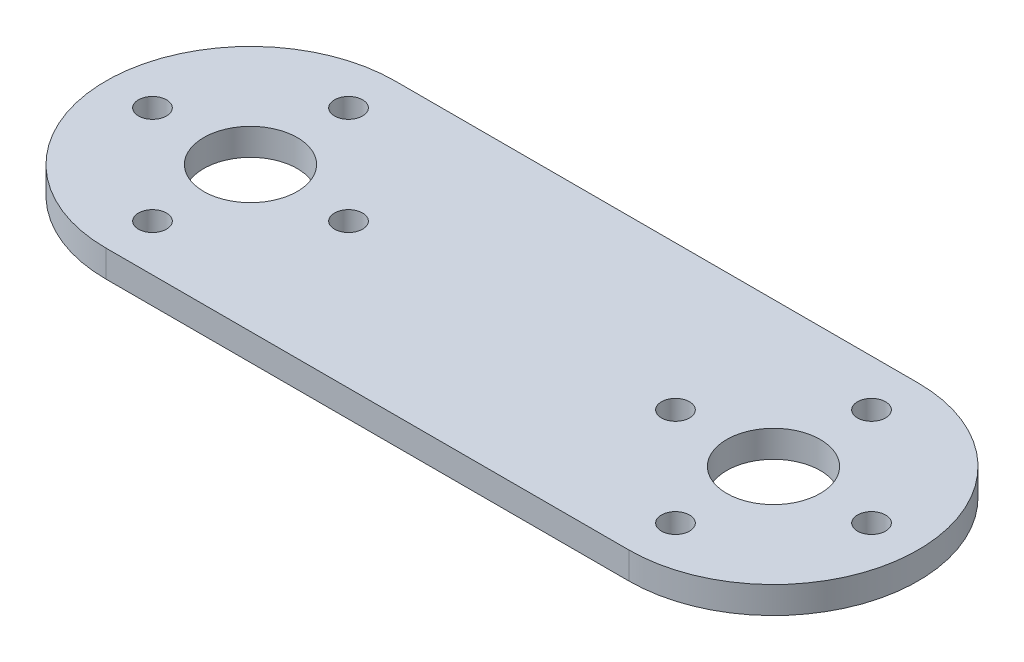
ISO-10303-21;
HEADER;
FILE_DESCRIPTION(('STEP AP214'),'2;1');
FILE_NAME('part.step','',(''),(''),'','','');
FILE_SCHEMA(('AUTOMOTIVE_DESIGN { 1 0 10303 214 1 1 1 1 }'));
ENDSEC;
DATA;
#1=APPLICATION_CONTEXT('core data for automotive mechanical design processes');
#2=APPLICATION_PROTOCOL_DEFINITION('international standard','automotive_design',2000,#1);
#3=PRODUCT_CONTEXT('',#1,'mechanical');
#4=PRODUCT('Part','Part','',(#3));
#5=PRODUCT_RELATED_PRODUCT_CATEGORY('part','',(#4));
#6=PRODUCT_DEFINITION_FORMATION('','',#4);
#7=PRODUCT_DEFINITION_CONTEXT('part definition',#1,'design');
#8=PRODUCT_DEFINITION('design','',#6,#7);
#9=PRODUCT_DEFINITION_SHAPE('','',#8);
#10=(LENGTH_UNIT() NAMED_UNIT(*) SI_UNIT(.MILLI.,.METRE.));
#11=(NAMED_UNIT(*) PLANE_ANGLE_UNIT() SI_UNIT($,.RADIAN.));
#12=(NAMED_UNIT(*) SI_UNIT($,.STERADIAN.) SOLID_ANGLE_UNIT());
#13=UNCERTAINTY_MEASURE_WITH_UNIT(LENGTH_MEASURE(1.E-05),#10,'distance_accuracy_value','');
#14=(GEOMETRIC_REPRESENTATION_CONTEXT(3) GLOBAL_UNCERTAINTY_ASSIGNED_CONTEXT((#13)) GLOBAL_UNIT_ASSIGNED_CONTEXT((#10,
#11,#12)) REPRESENTATION_CONTEXT('',''));
#15=CARTESIAN_POINT('',(0.,0.,0.));
#16=DIRECTION('',(0.,0.,1.));
#17=DIRECTION('',(1.,0.,0.));
#18=AXIS2_PLACEMENT_3D('',#15,#16,#17);
#19=CARTESIAN_POINT('',(22.225,2.286,0.));
#20=DIRECTION('',(0.,-1.,0.));
#21=DIRECTION('',(0.,0.,-1.));
#22=AXIS2_PLACEMENT_3D('',#19,#20,#21);
#23=CYLINDRICAL_SURFACE('',#22,12.2936);
#24=DIRECTION('',(0.,-1.,0.));
#25=VECTOR('',#24,1.);
#26=CARTESIAN_POINT('',(22.225,2.286,-12.2936));
#27=LINE('',#26,#25);
#28=CARTESIAN_POINT('',(22.225,2.286,-12.2936));
#29=VERTEX_POINT('',#28);
#30=CARTESIAN_POINT('',(22.225,0.,-12.2936));
#31=VERTEX_POINT('',#30);
#32=EDGE_CURVE('E76',#29,#31,#27,.T.);
#33=ORIENTED_EDGE('',*,*,#32,.F.);
#34=CARTESIAN_POINT('',(22.225,2.286,0.));
#35=DIRECTION('',(0.,1.,0.));
#36=DIRECTION('',(0.,0.,1.));
#37=AXIS2_PLACEMENT_3D('',#34,#35,#36);
#38=CIRCLE('',#37,12.2936);
#39=CARTESIAN_POINT('',(22.225,2.286,12.2936));
#40=VERTEX_POINT('',#39);
#41=EDGE_CURVE('E39',#40,#29,#38,.T.);
#42=ORIENTED_EDGE('',*,*,#41,.F.);
#43=DIRECTION('',(0.,-1.,0.));
#44=VECTOR('',#43,1.);
#45=CARTESIAN_POINT('',(22.225,2.286,12.2936));
#46=LINE('',#45,#44);
#47=CARTESIAN_POINT('',(22.225,0.,12.2936));
#48=VERTEX_POINT('',#47);
#49=EDGE_CURVE('E100',#48,#40,#46,.F.);
#50=ORIENTED_EDGE('',*,*,#49,.F.);
#51=CARTESIAN_POINT('',(22.225,0.,0.));
#52=DIRECTION('',(0.,1.,0.));
#53=DIRECTION('',(0.,0.,1.));
#54=AXIS2_PLACEMENT_3D('',#51,#52,#53);
#55=CIRCLE('',#54,12.2936);
#56=EDGE_CURVE('E11',#31,#48,#55,.F.);
#57=ORIENTED_EDGE('',*,*,#56,.F.);
#58=EDGE_LOOP('',(#33,#42,#50,#57));
#59=FACE_BOUND('',#58,.T.);
#60=ADVANCED_FACE('F32',(#59),#23,.T.);
#61=CARTESIAN_POINT('',(-22.225,0.,0.));
#62=DIRECTION('',(0.,-1.,0.));
#63=DIRECTION('',(0.,0.,-1.));
#64=AXIS2_PLACEMENT_3D('',#61,#62,#63);
#65=CYLINDRICAL_SURFACE('',#64,12.2936);
#66=DIRECTION('',(0.,-1.,0.));
#67=VECTOR('',#66,1.);
#68=CARTESIAN_POINT('',(-22.225,2.286,-12.2936));
#69=LINE('',#68,#67);
#70=CARTESIAN_POINT('',(-22.225,0.,-12.2936));
#71=VERTEX_POINT('',#70);
#72=CARTESIAN_POINT('',(-22.225,2.286,-12.2936));
#73=VERTEX_POINT('',#72);
#74=EDGE_CURVE('E75',#71,#73,#69,.F.);
#75=ORIENTED_EDGE('',*,*,#74,.F.);
#76=CARTESIAN_POINT('',(-22.225,0.,0.));
#77=DIRECTION('',(0.,1.,0.));
#78=DIRECTION('',(0.,0.,1.));
#79=AXIS2_PLACEMENT_3D('',#76,#77,#78);
#80=CIRCLE('',#79,12.2936);
#81=CARTESIAN_POINT('',(-22.225,0.,12.2936));
#82=VERTEX_POINT('',#81);
#83=EDGE_CURVE('E80',#82,#71,#80,.F.);
#84=ORIENTED_EDGE('',*,*,#83,.F.);
#85=DIRECTION('',(0.,-1.,0.));
#86=VECTOR('',#85,1.);
#87=CARTESIAN_POINT('',(-22.225,2.286,12.2936));
#88=LINE('',#87,#86);
#89=CARTESIAN_POINT('',(-22.225,2.286,12.2936));
#90=VERTEX_POINT('',#89);
#91=EDGE_CURVE('E88',#90,#82,#88,.T.);
#92=ORIENTED_EDGE('',*,*,#91,.F.);
#93=CARTESIAN_POINT('',(-22.225,2.286,0.));
#94=DIRECTION('',(0.,1.,0.));
#95=DIRECTION('',(0.,0.,1.));
#96=AXIS2_PLACEMENT_3D('',#93,#94,#95);
#97=CIRCLE('',#96,12.2936);
#98=EDGE_CURVE('E87',#73,#90,#97,.T.);
#99=ORIENTED_EDGE('',*,*,#98,.F.);
#100=EDGE_LOOP('',(#75,#84,#92,#99));
#101=FACE_BOUND('',#100,.T.);
#102=ADVANCED_FACE('F91',(#101),#65,.T.);
#103=CARTESIAN_POINT('',(-34.5186,2.286,12.2936));
#104=DIRECTION('',(0.,1.,0.));
#105=DIRECTION('',(0.,0.,1.));
#106=AXIS2_PLACEMENT_3D('',#103,#104,#105);
#107=PLANE('',#106);
#108=CARTESIAN_POINT('',(22.225,2.286,0.));
#109=DIRECTION('',(0.,1.,0.));
#110=DIRECTION('',(0.,0.,1.));
#111=AXIS2_PLACEMENT_3D('',#108,#109,#110);
#112=CIRCLE('',#111,3.9751);
#113=CARTESIAN_POINT('',(22.225,2.286,3.9751));
#114=VERTEX_POINT('',#113);
#115=EDGE_CURVE('E156',#114,#114,#112,.T.);
#116=ORIENTED_EDGE('',*,*,#115,.F.);
#117=EDGE_LOOP('',(#116));
#118=FACE_BOUND('',#117,.T.);
#119=CARTESIAN_POINT('',(22.225,2.286,-8.3312));
#120=DIRECTION('',(0.,1.,0.));
#121=DIRECTION('',(0.,0.,1.));
#122=AXIS2_PLACEMENT_3D('',#119,#120,#121);
#123=CIRCLE('',#122,1.1938);
#124=CARTESIAN_POINT('',(22.225,2.286,-7.1374));
#125=VERTEX_POINT('',#124);
#126=EDGE_CURVE('E144',#125,#125,#123,.T.);
#127=ORIENTED_EDGE('',*,*,#126,.F.);
#128=EDGE_LOOP('',(#127));
#129=FACE_BOUND('',#128,.T.);
#130=CARTESIAN_POINT('',(22.225,2.286,8.3312));
#131=DIRECTION('',(0.,1.,0.));
#132=DIRECTION('',(0.,0.,1.));
#133=AXIS2_PLACEMENT_3D('',#130,#131,#132);
#134=CIRCLE('',#133,1.1938);
#135=CARTESIAN_POINT('',(22.225,2.286,9.525));
#136=VERTEX_POINT('',#135);
#137=EDGE_CURVE('E132',#136,#136,#134,.T.);
#138=ORIENTED_EDGE('',*,*,#137,.F.);
#139=EDGE_LOOP('',(#138));
#140=FACE_BOUND('',#139,.T.);
#141=CARTESIAN_POINT('',(-22.225,2.286,8.3312));
#142=DIRECTION('',(0.,1.,0.));
#143=DIRECTION('',(0.,0.,1.));
#144=AXIS2_PLACEMENT_3D('',#141,#142,#143);
#145=CIRCLE('',#144,1.1938);
#146=CARTESIAN_POINT('',(-22.225,2.286,9.52500000000001));
#147=VERTEX_POINT('',#146);
#148=EDGE_CURVE('E120',#147,#147,#145,.T.);
#149=ORIENTED_EDGE('',*,*,#148,.F.);
#150=EDGE_LOOP('',(#149));
#151=FACE_BOUND('',#150,.T.);
#152=CARTESIAN_POINT('',(-22.225,2.286,-8.3312));
#153=DIRECTION('',(0.,1.,0.));
#154=DIRECTION('',(0.,0.,1.));
#155=AXIS2_PLACEMENT_3D('',#152,#153,#154);
#156=CIRCLE('',#155,1.1938);
#157=CARTESIAN_POINT('',(-22.225,2.286,-7.1374));
#158=VERTEX_POINT('',#157);
#159=EDGE_CURVE('E108',#158,#158,#156,.T.);
#160=ORIENTED_EDGE('',*,*,#159,.F.);
#161=EDGE_LOOP('',(#160));
#162=FACE_BOUND('',#161,.T.);
#163=DIRECTION('',(1.,0.,0.));
#164=VECTOR('',#163,1.);
#165=CARTESIAN_POINT('',(-34.5186,2.286,12.2936));
#166=LINE('',#165,#164);
#167=EDGE_CURVE('E77',#90,#40,#166,.T.);
#168=ORIENTED_EDGE('',*,*,#167,.T.);
#169=ORIENTED_EDGE('',*,*,#41,.T.);
#170=DIRECTION('',(-1.,0.,0.));
#171=VECTOR('',#170,1.);
#172=CARTESIAN_POINT('',(-34.5186,2.286,-12.2936));
#173=LINE('',#172,#171);
#174=EDGE_CURVE('E92',#29,#73,#173,.T.);
#175=ORIENTED_EDGE('',*,*,#174,.T.);
#176=ORIENTED_EDGE('',*,*,#98,.T.);
#177=EDGE_LOOP('',(#168,#169,#175,#176));
#178=FACE_BOUND('',#177,.T.);
#179=CARTESIAN_POINT('',(-13.8938,2.286,0.));
#180=DIRECTION('',(0.,1.,0.));
#181=DIRECTION('',(0.,0.,1.));
#182=AXIS2_PLACEMENT_3D('',#179,#180,#181);
#183=CIRCLE('',#182,1.1938);
#184=CARTESIAN_POINT('',(-13.8938,2.286,1.1938));
#185=VERTEX_POINT('',#184);
#186=EDGE_CURVE('E115',#185,#185,#183,.T.);
#187=ORIENTED_EDGE('',*,*,#186,.F.);
#188=EDGE_LOOP('',(#187));
#189=FACE_BOUND('',#188,.T.);
#190=CARTESIAN_POINT('',(-30.5562,2.286,0.));
#191=DIRECTION('',(0.,1.,0.));
#192=DIRECTION('',(0.,0.,1.));
#193=AXIS2_PLACEMENT_3D('',#190,#191,#192);
#194=CIRCLE('',#193,1.1938);
#195=CARTESIAN_POINT('',(-30.5562,2.286,1.1938));
#196=VERTEX_POINT('',#195);
#197=EDGE_CURVE('E126',#196,#196,#194,.T.);
#198=ORIENTED_EDGE('',*,*,#197,.F.);
#199=EDGE_LOOP('',(#198));
#200=FACE_BOUND('',#199,.T.);
#201=CARTESIAN_POINT('',(30.5562,2.286,0.));
#202=DIRECTION('',(0.,1.,0.));
#203=DIRECTION('',(0.,0.,1.));
#204=AXIS2_PLACEMENT_3D('',#201,#202,#203);
#205=CIRCLE('',#204,1.1938);
#206=CARTESIAN_POINT('',(30.5562,2.286,1.1938));
#207=VERTEX_POINT('',#206);
#208=EDGE_CURVE('E138',#207,#207,#205,.T.);
#209=ORIENTED_EDGE('',*,*,#208,.F.);
#210=EDGE_LOOP('',(#209));
#211=FACE_BOUND('',#210,.T.);
#212=CARTESIAN_POINT('',(13.8938,2.286,0.));
#213=DIRECTION('',(0.,1.,0.));
#214=DIRECTION('',(0.,0.,1.));
#215=AXIS2_PLACEMENT_3D('',#212,#213,#214);
#216=CIRCLE('',#215,1.1938);
#217=CARTESIAN_POINT('',(13.8938,2.286,1.1938));
#218=VERTEX_POINT('',#217);
#219=EDGE_CURVE('E150',#218,#218,#216,.T.);
#220=ORIENTED_EDGE('',*,*,#219,.F.);
#221=EDGE_LOOP('',(#220));
#222=FACE_BOUND('',#221,.T.);
#223=CARTESIAN_POINT('',(-22.225,2.286,0.));
#224=DIRECTION('',(0.,1.,0.));
#225=DIRECTION('',(0.,0.,1.));
#226=AXIS2_PLACEMENT_3D('',#223,#224,#225);
#227=CIRCLE('',#226,3.9751);
#228=CARTESIAN_POINT('',(-22.225,2.286,3.9751));
#229=VERTEX_POINT('',#228);
#230=EDGE_CURVE('E162',#229,#229,#227,.T.);
#231=ORIENTED_EDGE('',*,*,#230,.F.);
#232=EDGE_LOOP('',(#231));
#233=FACE_BOUND('',#232,.T.);
#234=ADVANCED_FACE('F103',(#118,#129,#140,#151,#162,#178,#189,#200,#211,#222,#233),#107,.T.);
#235=CARTESIAN_POINT('',(-34.5186,0.,12.2936));
#236=DIRECTION('',(0.,1.,0.));
#237=DIRECTION('',(0.,0.,1.));
#238=AXIS2_PLACEMENT_3D('',#235,#236,#237);
#239=PLANE('',#238);
#240=CARTESIAN_POINT('',(22.225,0.,0.));
#241=DIRECTION('',(0.,1.,0.));
#242=DIRECTION('',(0.,0.,1.));
#243=AXIS2_PLACEMENT_3D('',#240,#241,#242);
#244=CIRCLE('',#243,3.9751);
#245=CARTESIAN_POINT('',(22.225,0.,3.9751));
#246=VERTEX_POINT('',#245);
#247=EDGE_CURVE('E159',#246,#246,#244,.T.);
#248=ORIENTED_EDGE('',*,*,#247,.T.);
#249=EDGE_LOOP('',(#248));
#250=FACE_BOUND('',#249,.T.);
#251=CARTESIAN_POINT('',(22.225,0.,-8.3312));
#252=DIRECTION('',(0.,1.,0.));
#253=DIRECTION('',(0.,0.,1.));
#254=AXIS2_PLACEMENT_3D('',#251,#252,#253);
#255=CIRCLE('',#254,1.1938);
#256=CARTESIAN_POINT('',(22.225,0.,-7.1374));
#257=VERTEX_POINT('',#256);
#258=EDGE_CURVE('E147',#257,#257,#255,.T.);
#259=ORIENTED_EDGE('',*,*,#258,.T.);
#260=EDGE_LOOP('',(#259));
#261=FACE_BOUND('',#260,.T.);
#262=CARTESIAN_POINT('',(22.225,0.,8.3312));
#263=DIRECTION('',(0.,1.,0.));
#264=DIRECTION('',(0.,0.,1.));
#265=AXIS2_PLACEMENT_3D('',#262,#263,#264);
#266=CIRCLE('',#265,1.1938);
#267=CARTESIAN_POINT('',(22.225,0.,9.525));
#268=VERTEX_POINT('',#267);
#269=EDGE_CURVE('E135',#268,#268,#266,.T.);
#270=ORIENTED_EDGE('',*,*,#269,.T.);
#271=EDGE_LOOP('',(#270));
#272=FACE_BOUND('',#271,.T.);
#273=CARTESIAN_POINT('',(-22.225,0.,8.3312));
#274=DIRECTION('',(0.,1.,0.));
#275=DIRECTION('',(0.,0.,1.));
#276=AXIS2_PLACEMENT_3D('',#273,#274,#275);
#277=CIRCLE('',#276,1.1938);
#278=CARTESIAN_POINT('',(-22.225,0.,9.52500000000001));
#279=VERTEX_POINT('',#278);
#280=EDGE_CURVE('E123',#279,#279,#277,.T.);
#281=ORIENTED_EDGE('',*,*,#280,.T.);
#282=EDGE_LOOP('',(#281));
#283=FACE_BOUND('',#282,.T.);
#284=CARTESIAN_POINT('',(-22.225,0.,-8.3312));
#285=DIRECTION('',(0.,1.,0.));
#286=DIRECTION('',(0.,0.,1.));
#287=AXIS2_PLACEMENT_3D('',#284,#285,#286);
#288=CIRCLE('',#287,1.1938);
#289=CARTESIAN_POINT('',(-22.225,0.,-7.1374));
#290=VERTEX_POINT('',#289);
#291=EDGE_CURVE('E110',#290,#290,#288,.T.);
#292=ORIENTED_EDGE('',*,*,#291,.T.);
#293=EDGE_LOOP('',(#292));
#294=FACE_BOUND('',#293,.T.);
#295=DIRECTION('',(-1.,0.,0.));
#296=VECTOR('',#295,1.);
#297=CARTESIAN_POINT('',(-34.5186,0.,-12.2936));
#298=LINE('',#297,#296);
#299=EDGE_CURVE('E70',#31,#71,#298,.T.);
#300=ORIENTED_EDGE('',*,*,#299,.F.);
#301=ORIENTED_EDGE('',*,*,#56,.T.);
#302=DIRECTION('',(1.,0.,0.));
#303=VECTOR('',#302,1.);
#304=CARTESIAN_POINT('',(-34.5186,0.,12.2936));
#305=LINE('',#304,#303);
#306=EDGE_CURVE('E78',#82,#48,#305,.T.);
#307=ORIENTED_EDGE('',*,*,#306,.F.);
#308=ORIENTED_EDGE('',*,*,#83,.T.);
#309=EDGE_LOOP('',(#300,#301,#307,#308));
#310=FACE_BOUND('',#309,.T.);
#311=CARTESIAN_POINT('',(-13.8938,0.,0.));
#312=DIRECTION('',(0.,1.,0.));
#313=DIRECTION('',(0.,0.,1.));
#314=AXIS2_PLACEMENT_3D('',#311,#312,#313);
#315=CIRCLE('',#314,1.1938);
#316=CARTESIAN_POINT('',(-13.8938,0.,1.1938));
#317=VERTEX_POINT('',#316);
#318=EDGE_CURVE('E117',#317,#317,#315,.T.);
#319=ORIENTED_EDGE('',*,*,#318,.T.);
#320=EDGE_LOOP('',(#319));
#321=FACE_BOUND('',#320,.T.);
#322=CARTESIAN_POINT('',(-30.5562,0.,0.));
#323=DIRECTION('',(0.,1.,0.));
#324=DIRECTION('',(0.,0.,1.));
#325=AXIS2_PLACEMENT_3D('',#322,#323,#324);
#326=CIRCLE('',#325,1.1938);
#327=CARTESIAN_POINT('',(-30.5562,0.,1.1938));
#328=VERTEX_POINT('',#327);
#329=EDGE_CURVE('E129',#328,#328,#326,.T.);
#330=ORIENTED_EDGE('',*,*,#329,.T.);
#331=EDGE_LOOP('',(#330));
#332=FACE_BOUND('',#331,.T.);
#333=CARTESIAN_POINT('',(30.5562,0.,0.));
#334=DIRECTION('',(0.,1.,0.));
#335=DIRECTION('',(0.,0.,1.));
#336=AXIS2_PLACEMENT_3D('',#333,#334,#335);
#337=CIRCLE('',#336,1.1938);
#338=CARTESIAN_POINT('',(30.5562,0.,1.1938));
#339=VERTEX_POINT('',#338);
#340=EDGE_CURVE('E141',#339,#339,#337,.T.);
#341=ORIENTED_EDGE('',*,*,#340,.T.);
#342=EDGE_LOOP('',(#341));
#343=FACE_BOUND('',#342,.T.);
#344=CARTESIAN_POINT('',(13.8938,0.,0.));
#345=DIRECTION('',(0.,1.,0.));
#346=DIRECTION('',(0.,0.,1.));
#347=AXIS2_PLACEMENT_3D('',#344,#345,#346);
#348=CIRCLE('',#347,1.1938);
#349=CARTESIAN_POINT('',(13.8938,0.,1.1938));
#350=VERTEX_POINT('',#349);
#351=EDGE_CURVE('E153',#350,#350,#348,.T.);
#352=ORIENTED_EDGE('',*,*,#351,.T.);
#353=EDGE_LOOP('',(#352));
#354=FACE_BOUND('',#353,.T.);
#355=CARTESIAN_POINT('',(-22.225,0.,0.));
#356=DIRECTION('',(0.,1.,0.));
#357=DIRECTION('',(0.,0.,1.));
#358=AXIS2_PLACEMENT_3D('',#355,#356,#357);
#359=CIRCLE('',#358,3.9751);
#360=CARTESIAN_POINT('',(-22.225,0.,3.9751));
#361=VERTEX_POINT('',#360);
#362=EDGE_CURVE('E165',#361,#361,#359,.T.);
#363=ORIENTED_EDGE('',*,*,#362,.T.);
#364=EDGE_LOOP('',(#363));
#365=FACE_BOUND('',#364,.T.);
#366=ADVANCED_FACE('F81',(#250,#261,#272,#283,#294,#310,#321,#332,#343,#354,#365),#239,.F.);
#367=CARTESIAN_POINT('',(-34.5186,2.286,12.2936));
#368=DIRECTION('',(0.,0.,-1.));
#369=DIRECTION('',(-1.,0.,0.));
#370=AXIS2_PLACEMENT_3D('',#367,#368,#369);
#371=PLANE('',#370);
#372=ORIENTED_EDGE('',*,*,#306,.T.);
#373=ORIENTED_EDGE('',*,*,#49,.T.);
#374=ORIENTED_EDGE('',*,*,#167,.F.);
#375=ORIENTED_EDGE('',*,*,#91,.T.);
#376=EDGE_LOOP('',(#372,#373,#374,#375));
#377=FACE_BOUND('',#376,.T.);
#378=ADVANCED_FACE('F107',(#377),#371,.F.);
#379=CARTESIAN_POINT('',(-34.5186,2.286,-12.2936));
#380=DIRECTION('',(0.,0.,1.));
#381=DIRECTION('',(1.,0.,0.));
#382=AXIS2_PLACEMENT_3D('',#379,#380,#381);
#383=PLANE('',#382);
#384=ORIENTED_EDGE('',*,*,#174,.F.);
#385=ORIENTED_EDGE('',*,*,#32,.T.);
#386=ORIENTED_EDGE('',*,*,#299,.T.);
#387=ORIENTED_EDGE('',*,*,#74,.T.);
#388=EDGE_LOOP('',(#384,#385,#386,#387));
#389=FACE_BOUND('',#388,.T.);
#390=ADVANCED_FACE('F73',(#389),#383,.F.);
#391=CARTESIAN_POINT('',(-22.225,2.286,-8.3312));
#392=DIRECTION('',(0.,-1.,0.));
#393=DIRECTION('',(0.,0.,-1.));
#394=AXIS2_PLACEMENT_3D('',#391,#392,#393);
#395=CYLINDRICAL_SURFACE('',#394,1.1938);
#396=ORIENTED_EDGE('',*,*,#159,.T.);
#397=EDGE_LOOP('',(#396));
#398=FACE_BOUND('',#397,.T.);
#399=ORIENTED_EDGE('',*,*,#291,.F.);
#400=EDGE_LOOP('',(#399));
#401=FACE_BOUND('',#400,.T.);
#402=ADVANCED_FACE('F289',(#398,#401),#395,.F.);
#403=CARTESIAN_POINT('',(-13.8938,2.286,0.));
#404=DIRECTION('',(0.,-1.,0.));
#405=DIRECTION('',(0.,0.,-1.));
#406=AXIS2_PLACEMENT_3D('',#403,#404,#405);
#407=CYLINDRICAL_SURFACE('',#406,1.1938);
#408=ORIENTED_EDGE('',*,*,#186,.T.);
#409=EDGE_LOOP('',(#408));
#410=FACE_BOUND('',#409,.T.);
#411=ORIENTED_EDGE('',*,*,#318,.F.);
#412=EDGE_LOOP('',(#411));
#413=FACE_BOUND('',#412,.T.);
#414=ADVANCED_FACE('F278',(#410,#413),#407,.F.);
#415=CARTESIAN_POINT('',(-22.225,2.286,8.3312));
#416=DIRECTION('',(0.,-1.,0.));
#417=DIRECTION('',(0.,0.,-1.));
#418=AXIS2_PLACEMENT_3D('',#415,#416,#417);
#419=CYLINDRICAL_SURFACE('',#418,1.1938);
#420=ORIENTED_EDGE('',*,*,#148,.T.);
#421=EDGE_LOOP('',(#420));
#422=FACE_BOUND('',#421,.T.);
#423=ORIENTED_EDGE('',*,*,#280,.F.);
#424=EDGE_LOOP('',(#423));
#425=FACE_BOUND('',#424,.T.);
#426=ADVANCED_FACE('F267',(#422,#425),#419,.F.);
#427=CARTESIAN_POINT('',(-30.5562,2.286,0.));
#428=DIRECTION('',(0.,-1.,0.));
#429=DIRECTION('',(0.,0.,-1.));
#430=AXIS2_PLACEMENT_3D('',#427,#428,#429);
#431=CYLINDRICAL_SURFACE('',#430,1.1938);
#432=ORIENTED_EDGE('',*,*,#197,.T.);
#433=EDGE_LOOP('',(#432));
#434=FACE_BOUND('',#433,.T.);
#435=ORIENTED_EDGE('',*,*,#329,.F.);
#436=EDGE_LOOP('',(#435));
#437=FACE_BOUND('',#436,.T.);
#438=ADVANCED_FACE('F256',(#434,#437),#431,.F.);
#439=CARTESIAN_POINT('',(22.225,2.286,8.3312));
#440=DIRECTION('',(0.,-1.,0.));
#441=DIRECTION('',(0.,0.,-1.));
#442=AXIS2_PLACEMENT_3D('',#439,#440,#441);
#443=CYLINDRICAL_SURFACE('',#442,1.1938);
#444=ORIENTED_EDGE('',*,*,#137,.T.);
#445=EDGE_LOOP('',(#444));
#446=FACE_BOUND('',#445,.T.);
#447=ORIENTED_EDGE('',*,*,#269,.F.);
#448=EDGE_LOOP('',(#447));
#449=FACE_BOUND('',#448,.T.);
#450=ADVANCED_FACE('F245',(#446,#449),#443,.F.);
#451=CARTESIAN_POINT('',(30.5562,2.286,0.));
#452=DIRECTION('',(0.,-1.,0.));
#453=DIRECTION('',(0.,0.,-1.));
#454=AXIS2_PLACEMENT_3D('',#451,#452,#453);
#455=CYLINDRICAL_SURFACE('',#454,1.1938);
#456=ORIENTED_EDGE('',*,*,#208,.T.);
#457=EDGE_LOOP('',(#456));
#458=FACE_BOUND('',#457,.T.);
#459=ORIENTED_EDGE('',*,*,#340,.F.);
#460=EDGE_LOOP('',(#459));
#461=FACE_BOUND('',#460,.T.);
#462=ADVANCED_FACE('F234',(#458,#461),#455,.F.);
#463=CARTESIAN_POINT('',(22.225,2.286,-8.3312));
#464=DIRECTION('',(0.,-1.,0.));
#465=DIRECTION('',(0.,0.,-1.));
#466=AXIS2_PLACEMENT_3D('',#463,#464,#465);
#467=CYLINDRICAL_SURFACE('',#466,1.1938);
#468=ORIENTED_EDGE('',*,*,#126,.T.);
#469=EDGE_LOOP('',(#468));
#470=FACE_BOUND('',#469,.T.);
#471=ORIENTED_EDGE('',*,*,#258,.F.);
#472=EDGE_LOOP('',(#471));
#473=FACE_BOUND('',#472,.T.);
#474=ADVANCED_FACE('F223',(#470,#473),#467,.F.);
#475=CARTESIAN_POINT('',(13.8938,2.286,0.));
#476=DIRECTION('',(0.,-1.,0.));
#477=DIRECTION('',(0.,0.,-1.));
#478=AXIS2_PLACEMENT_3D('',#475,#476,#477);
#479=CYLINDRICAL_SURFACE('',#478,1.1938);
#480=ORIENTED_EDGE('',*,*,#219,.T.);
#481=EDGE_LOOP('',(#480));
#482=FACE_BOUND('',#481,.T.);
#483=ORIENTED_EDGE('',*,*,#351,.F.);
#484=EDGE_LOOP('',(#483));
#485=FACE_BOUND('',#484,.T.);
#486=ADVANCED_FACE('F212',(#482,#485),#479,.F.);
#487=CARTESIAN_POINT('',(22.225,2.286,0.));
#488=DIRECTION('',(0.,-1.,0.));
#489=DIRECTION('',(0.,0.,-1.));
#490=AXIS2_PLACEMENT_3D('',#487,#488,#489);
#491=CYLINDRICAL_SURFACE('',#490,3.9751);
#492=ORIENTED_EDGE('',*,*,#115,.T.);
#493=EDGE_LOOP('',(#492));
#494=FACE_BOUND('',#493,.T.);
#495=ORIENTED_EDGE('',*,*,#247,.F.);
#496=EDGE_LOOP('',(#495));
#497=FACE_BOUND('',#496,.T.);
#498=ADVANCED_FACE('F202',(#494,#497),#491,.F.);
#499=CARTESIAN_POINT('',(-22.225,2.286,0.));
#500=DIRECTION('',(0.,-1.,0.));
#501=DIRECTION('',(0.,0.,-1.));
#502=AXIS2_PLACEMENT_3D('',#499,#500,#501);
#503=CYLINDRICAL_SURFACE('',#502,3.9751);
#504=ORIENTED_EDGE('',*,*,#230,.T.);
#505=EDGE_LOOP('',(#504));
#506=FACE_BOUND('',#505,.T.);
#507=ORIENTED_EDGE('',*,*,#362,.F.);
#508=EDGE_LOOP('',(#507));
#509=FACE_BOUND('',#508,.T.);
#510=ADVANCED_FACE('F171',(#506,#509),#503,.F.);
#511=CLOSED_SHELL('',(#60,#102,#234,#366,#378,#390,#402,#414,#426,#438,#450,#462,#474,#486,#498,#510));
#512=MANIFOLD_SOLID_BREP('B2',#511);
#513=ADVANCED_BREP_SHAPE_REPRESENTATION('',(#18,#512),#14);
#514=SHAPE_DEFINITION_REPRESENTATION(#9,#513);
ENDSEC;
END-ISO-10303-21;
